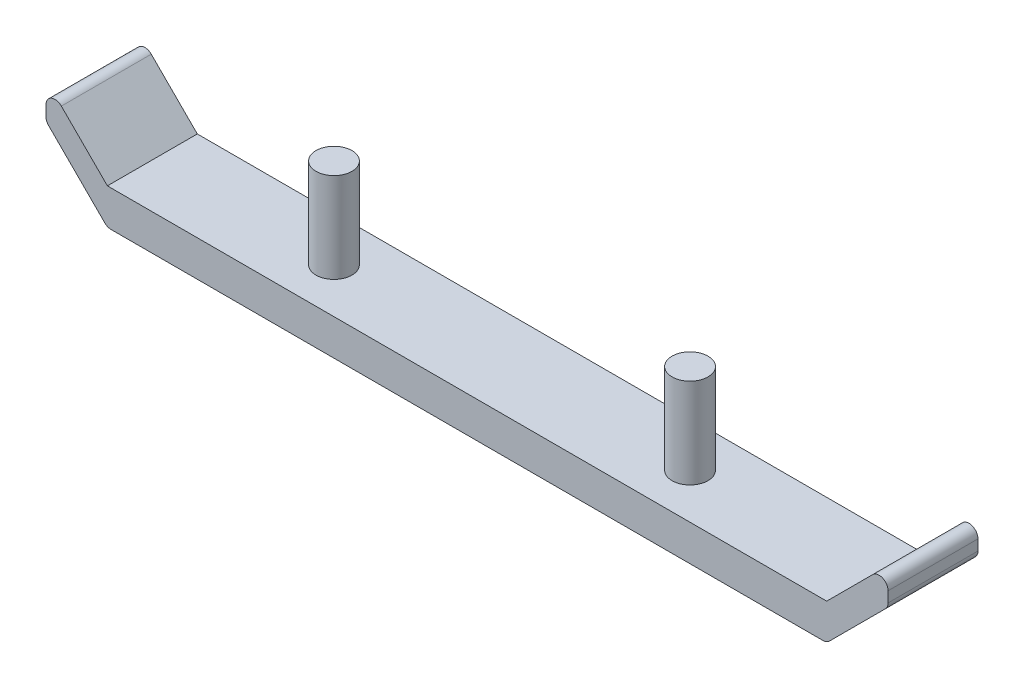
ISO-10303-21;
HEADER;
FILE_DESCRIPTION(('STEP AP214'),'2;1');
FILE_NAME('part.step','',(''),(''),'','','');
FILE_SCHEMA(('AUTOMOTIVE_DESIGN { 1 0 10303 214 1 1 1 1 }'));
ENDSEC;
DATA;
#1=APPLICATION_CONTEXT('core data for automotive mechanical design processes');
#2=APPLICATION_PROTOCOL_DEFINITION('international standard','automotive_design',2000,#1);
#3=PRODUCT_CONTEXT('',#1,'mechanical');
#4=PRODUCT('Part','Part','',(#3));
#5=PRODUCT_RELATED_PRODUCT_CATEGORY('part','',(#4));
#6=PRODUCT_DEFINITION_FORMATION('','',#4);
#7=PRODUCT_DEFINITION_CONTEXT('part definition',#1,'design');
#8=PRODUCT_DEFINITION('design','',#6,#7);
#9=PRODUCT_DEFINITION_SHAPE('','',#8);
#10=(LENGTH_UNIT() NAMED_UNIT(*) SI_UNIT(.MILLI.,.METRE.));
#11=(NAMED_UNIT(*) PLANE_ANGLE_UNIT() SI_UNIT($,.RADIAN.));
#12=(NAMED_UNIT(*) SI_UNIT($,.STERADIAN.) SOLID_ANGLE_UNIT());
#13=UNCERTAINTY_MEASURE_WITH_UNIT(LENGTH_MEASURE(1.E-05),#10,'distance_accuracy_value','');
#14=(GEOMETRIC_REPRESENTATION_CONTEXT(3) GLOBAL_UNCERTAINTY_ASSIGNED_CONTEXT((#13)) GLOBAL_UNIT_ASSIGNED_CONTEXT((#10,
#11,#12)) REPRESENTATION_CONTEXT('',''));
#15=CARTESIAN_POINT('',(0.,0.,0.));
#16=DIRECTION('',(0.,0.,1.));
#17=DIRECTION('',(1.,0.,0.));
#18=AXIS2_PLACEMENT_3D('',#15,#16,#17);
#19=CARTESIAN_POINT('',(0.,-20.,25.));
#20=DIRECTION('',(0.,0.,-1.));
#21=DIRECTION('',(-1.,0.,0.));
#22=AXIS2_PLACEMENT_3D('',#19,#20,#21);
#23=PLANE('',#22);
#24=DIRECTION('',(-0.707106781186548,0.707106781186547,0.));
#25=VECTOR('',#24,1.);
#26=CARTESIAN_POINT('',(-217.071067811866,17.0710678118655,25.));
#27=LINE('',#26,#25);
#28=CARTESIAN_POINT('',(-200.,0.,25.));
#29=VERTEX_POINT('',#28);
#30=CARTESIAN_POINT('',(-225.606601717798,25.6066017177982,25.));
#31=VERTEX_POINT('',#30);
#32=EDGE_CURVE('E169',#29,#31,#27,.T.);
#33=ORIENTED_EDGE('',*,*,#32,.T.);
#34=CARTESIAN_POINT('',(-229.142135623731,22.0710678118655,25.));
#35=DIRECTION('',(0.,0.,-1.));
#36=DIRECTION('',(-1.,0.,0.));
#37=AXIS2_PLACEMENT_3D('',#34,#35,#36);
#38=CIRCLE('',#37,5.);
#39=CARTESIAN_POINT('',(-234.142135623731,22.0710678118655,25.));
#40=VERTEX_POINT('',#39);
#41=EDGE_CURVE('E260',#31,#40,#38,.F.);
#42=ORIENTED_EDGE('',*,*,#41,.T.);
#43=DIRECTION('',(0.,1.,0.));
#44=VECTOR('',#43,1.);
#45=CARTESIAN_POINT('',(-234.142135623731,24.142135623731,25.));
#46=LINE('',#45,#44);
#47=CARTESIAN_POINT('',(-234.142135623731,16.2132034355965,25.));
#48=VERTEX_POINT('',#47);
#49=EDGE_CURVE('E180',#48,#40,#46,.T.);
#50=ORIENTED_EDGE('',*,*,#49,.F.);
#51=CARTESIAN_POINT('',(-229.142135623731,16.2132034355965,25.));
#52=DIRECTION('',(0.,0.,-1.));
#53=DIRECTION('',(-1.,0.,0.));
#54=AXIS2_PLACEMENT_3D('',#51,#52,#53);
#55=CIRCLE('',#54,5.);
#56=CARTESIAN_POINT('',(-232.677669529664,12.6776695296637,25.));
#57=VERTEX_POINT('',#56);
#58=EDGE_CURVE('E257',#48,#57,#55,.F.);
#59=ORIENTED_EDGE('',*,*,#58,.T.);
#60=DIRECTION('',(-0.707106781186548,0.707106781186547,0.));
#61=VECTOR('',#60,1.);
#62=CARTESIAN_POINT('',(-227.071067811865,7.07106781186547,25.));
#63=LINE('',#62,#61);
#64=CARTESIAN_POINT('',(-201.464466094068,-18.5355339059328,25.));
#65=VERTEX_POINT('',#64);
#66=EDGE_CURVE('E187',#65,#57,#63,.T.);
#67=ORIENTED_EDGE('',*,*,#66,.F.);
#68=CARTESIAN_POINT('',(-197.928932188134,-15.,25.));
#69=DIRECTION('',(0.,0.,-1.));
#70=DIRECTION('',(-1.,0.,0.));
#71=AXIS2_PLACEMENT_3D('',#68,#69,#70);
#72=CIRCLE('',#71,5.);
#73=CARTESIAN_POINT('',(-197.928932188134,-20.,25.));
#74=VERTEX_POINT('',#73);
#75=EDGE_CURVE('E248',#65,#74,#72,.F.);
#76=ORIENTED_EDGE('',*,*,#75,.T.);
#77=DIRECTION('',(-1.,0.,0.));
#78=VECTOR('',#77,1.);
#79=CARTESIAN_POINT('',(0.,-20.,25.));
#80=LINE('',#79,#78);
#81=CARTESIAN_POINT('',(197.928932188134,-20.,25.));
#82=VERTEX_POINT('',#81);
#83=EDGE_CURVE('E231',#82,#74,#80,.T.);
#84=ORIENTED_EDGE('',*,*,#83,.F.);
#85=CARTESIAN_POINT('',(197.928932188134,-15.,25.));
#86=DIRECTION('',(0.,0.,-1.));
#87=DIRECTION('',(-1.,0.,0.));
#88=AXIS2_PLACEMENT_3D('',#85,#86,#87);
#89=CIRCLE('',#88,5.);
#90=CARTESIAN_POINT('',(201.464466094068,-18.5355339059328,25.));
#91=VERTEX_POINT('',#90);
#92=EDGE_CURVE('E245',#82,#91,#89,.F.);
#93=ORIENTED_EDGE('',*,*,#92,.T.);
#94=DIRECTION('',(0.707106781186547,0.707106781186548,0.));
#95=VECTOR('',#94,1.);
#96=CARTESIAN_POINT('',(227.071067811865,7.07106781186547,25.));
#97=LINE('',#96,#95);
#98=CARTESIAN_POINT('',(232.677669529664,12.6776695296637,25.));
#99=VERTEX_POINT('',#98);
#100=EDGE_CURVE('E212',#91,#99,#97,.T.);
#101=ORIENTED_EDGE('',*,*,#100,.T.);
#102=CARTESIAN_POINT('',(229.142135623731,16.2132034355965,25.));
#103=DIRECTION('',(0.,0.,-1.));
#104=DIRECTION('',(-1.,0.,0.));
#105=AXIS2_PLACEMENT_3D('',#102,#103,#104);
#106=CIRCLE('',#105,5.);
#107=CARTESIAN_POINT('',(234.142135623731,16.2132034355965,25.));
#108=VERTEX_POINT('',#107);
#109=EDGE_CURVE('E251',#99,#108,#106,.F.);
#110=ORIENTED_EDGE('',*,*,#109,.T.);
#111=DIRECTION('',(0.,1.,0.));
#112=VECTOR('',#111,1.);
#113=CARTESIAN_POINT('',(234.142135623731,24.142135623731,25.));
#114=LINE('',#113,#112);
#115=CARTESIAN_POINT('',(234.142135623731,22.0710678118655,25.));
#116=VERTEX_POINT('',#115);
#117=EDGE_CURVE('E208',#108,#116,#114,.T.);
#118=ORIENTED_EDGE('',*,*,#117,.T.);
#119=CARTESIAN_POINT('',(229.142135623731,22.0710678118655,25.));
#120=DIRECTION('',(0.,0.,-1.));
#121=DIRECTION('',(-1.,0.,0.));
#122=AXIS2_PLACEMENT_3D('',#119,#120,#121);
#123=CIRCLE('',#122,5.);
#124=CARTESIAN_POINT('',(225.606601717798,25.6066017177982,25.));
#125=VERTEX_POINT('',#124);
#126=EDGE_CURVE('E254',#116,#125,#123,.F.);
#127=ORIENTED_EDGE('',*,*,#126,.T.);
#128=DIRECTION('',(-0.707106781186548,-0.707106781186547,0.));
#129=VECTOR('',#128,1.);
#130=CARTESIAN_POINT('',(217.071067811866,17.0710678118655,25.));
#131=LINE('',#130,#129);
#132=CARTESIAN_POINT('',(200.,0.,25.));
#133=VERTEX_POINT('',#132);
#134=EDGE_CURVE('E171',#125,#133,#131,.T.);
#135=ORIENTED_EDGE('',*,*,#134,.T.);
#136=DIRECTION('',(-1.,0.,0.));
#137=VECTOR('',#136,1.);
#138=CARTESIAN_POINT('',(0.,0.,25.));
#139=LINE('',#138,#137);
#140=EDGE_CURVE('E157',#133,#29,#139,.T.);
#141=ORIENTED_EDGE('',*,*,#140,.T.);
#142=EDGE_LOOP('',(#33,#42,#50,#59,#67,#76,#84,#93,#101,#110,#118,#127,#135,#141));
#143=FACE_BOUND('',#142,.T.);
#144=ADVANCED_FACE('F17',(#143),#23,.F.);
#145=CARTESIAN_POINT('',(0.,-20.,-25.));
#146=DIRECTION('',(0.,0.,-1.));
#147=DIRECTION('',(-1.,0.,0.));
#148=AXIS2_PLACEMENT_3D('',#145,#146,#147);
#149=PLANE('',#148);
#150=DIRECTION('',(0.,1.,0.));
#151=VECTOR('',#150,1.);
#152=CARTESIAN_POINT('',(-234.142135623731,24.142135623731,-25.));
#153=LINE('',#152,#151);
#154=CARTESIAN_POINT('',(-234.142135623731,16.2132034355965,-25.));
#155=VERTEX_POINT('',#154);
#156=CARTESIAN_POINT('',(-234.142135623731,22.0710678118655,-25.));
#157=VERTEX_POINT('',#156);
#158=EDGE_CURVE('E345',#155,#157,#153,.T.);
#159=ORIENTED_EDGE('',*,*,#158,.T.);
#160=CARTESIAN_POINT('',(-229.142135623731,22.0710678118655,-25.));
#161=DIRECTION('',(0.,0.,-1.));
#162=DIRECTION('',(-1.,0.,0.));
#163=AXIS2_PLACEMENT_3D('',#160,#161,#162);
#164=CIRCLE('',#163,5.);
#165=CARTESIAN_POINT('',(-225.606601717798,25.6066017177982,-25.));
#166=VERTEX_POINT('',#165);
#167=EDGE_CURVE('E283',#157,#166,#164,.T.);
#168=ORIENTED_EDGE('',*,*,#167,.T.);
#169=DIRECTION('',(-0.707106781186548,0.707106781186547,0.));
#170=VECTOR('',#169,1.);
#171=CARTESIAN_POINT('',(-217.071067811866,17.0710678118655,-25.));
#172=LINE('',#171,#170);
#173=CARTESIAN_POINT('',(-200.,0.,-25.));
#174=VERTEX_POINT('',#173);
#175=EDGE_CURVE('E195',#174,#166,#172,.T.);
#176=ORIENTED_EDGE('',*,*,#175,.F.);
#177=DIRECTION('',(-1.,0.,0.));
#178=VECTOR('',#177,1.);
#179=CARTESIAN_POINT('',(0.,0.,-25.));
#180=LINE('',#179,#178);
#181=CARTESIAN_POINT('',(200.,0.,-25.));
#182=VERTEX_POINT('',#181);
#183=EDGE_CURVE('E160',#182,#174,#180,.T.);
#184=ORIENTED_EDGE('',*,*,#183,.F.);
#185=DIRECTION('',(-0.707106781186548,-0.707106781186547,0.));
#186=VECTOR('',#185,1.);
#187=CARTESIAN_POINT('',(217.071067811866,17.0710678118655,-25.));
#188=LINE('',#187,#186);
#189=CARTESIAN_POINT('',(225.606601717798,25.6066017177982,-25.));
#190=VERTEX_POINT('',#189);
#191=EDGE_CURVE('E204',#190,#182,#188,.T.);
#192=ORIENTED_EDGE('',*,*,#191,.F.);
#193=CARTESIAN_POINT('',(229.142135623731,22.0710678118655,-25.));
#194=DIRECTION('',(0.,0.,-1.));
#195=DIRECTION('',(-1.,0.,0.));
#196=AXIS2_PLACEMENT_3D('',#193,#194,#195);
#197=CIRCLE('',#196,5.);
#198=CARTESIAN_POINT('',(234.142135623731,22.0710678118655,-25.));
#199=VERTEX_POINT('',#198);
#200=EDGE_CURVE('E277',#190,#199,#197,.T.);
#201=ORIENTED_EDGE('',*,*,#200,.T.);
#202=DIRECTION('',(0.,1.,0.));
#203=VECTOR('',#202,1.);
#204=CARTESIAN_POINT('',(234.142135623731,24.142135623731,-25.));
#205=LINE('',#204,#203);
#206=CARTESIAN_POINT('',(234.142135623731,16.2132034355965,-25.));
#207=VERTEX_POINT('',#206);
#208=EDGE_CURVE('E196',#207,#199,#205,.T.);
#209=ORIENTED_EDGE('',*,*,#208,.F.);
#210=CARTESIAN_POINT('',(229.142135623731,16.2132034355965,-25.));
#211=DIRECTION('',(0.,0.,-1.));
#212=DIRECTION('',(-1.,0.,0.));
#213=AXIS2_PLACEMENT_3D('',#210,#211,#212);
#214=CIRCLE('',#213,5.);
#215=CARTESIAN_POINT('',(232.677669529664,12.6776695296637,-25.));
#216=VERTEX_POINT('',#215);
#217=EDGE_CURVE('E274',#207,#216,#214,.T.);
#218=ORIENTED_EDGE('',*,*,#217,.T.);
#219=DIRECTION('',(0.707106781186547,0.707106781186548,0.));
#220=VECTOR('',#219,1.);
#221=CARTESIAN_POINT('',(227.071067811865,7.07106781186547,-25.));
#222=LINE('',#221,#220);
#223=CARTESIAN_POINT('',(201.464466094068,-18.5355339059328,-25.));
#224=VERTEX_POINT('',#223);
#225=EDGE_CURVE('E200',#224,#216,#222,.T.);
#226=ORIENTED_EDGE('',*,*,#225,.F.);
#227=CARTESIAN_POINT('',(197.928932188134,-15.,-25.));
#228=DIRECTION('',(0.,0.,-1.));
#229=DIRECTION('',(-1.,0.,0.));
#230=AXIS2_PLACEMENT_3D('',#227,#228,#229);
#231=CIRCLE('',#230,5.);
#232=CARTESIAN_POINT('',(197.928932188134,-20.,-25.));
#233=VERTEX_POINT('',#232);
#234=EDGE_CURVE('E270',#224,#233,#231,.T.);
#235=ORIENTED_EDGE('',*,*,#234,.T.);
#236=DIRECTION('',(-1.,0.,0.));
#237=VECTOR('',#236,1.);
#238=CARTESIAN_POINT('',(0.,-20.,-25.));
#239=LINE('',#238,#237);
#240=CARTESIAN_POINT('',(-197.928932188134,-20.,-25.));
#241=VERTEX_POINT('',#240);
#242=EDGE_CURVE('E230',#233,#241,#239,.T.);
#243=ORIENTED_EDGE('',*,*,#242,.T.);
#244=CARTESIAN_POINT('',(-197.928932188134,-15.,-25.));
#245=DIRECTION('',(0.,0.,-1.));
#246=DIRECTION('',(-1.,0.,0.));
#247=AXIS2_PLACEMENT_3D('',#244,#245,#246);
#248=CIRCLE('',#247,5.);
#249=CARTESIAN_POINT('',(-201.464466094068,-18.5355339059328,-25.));
#250=VERTEX_POINT('',#249);
#251=EDGE_CURVE('E49',#241,#250,#248,.T.);
#252=ORIENTED_EDGE('',*,*,#251,.T.);
#253=DIRECTION('',(-0.707106781186548,0.707106781186547,0.));
#254=VECTOR('',#253,1.);
#255=CARTESIAN_POINT('',(-227.071067811865,7.07106781186547,-25.));
#256=LINE('',#255,#254);
#257=CARTESIAN_POINT('',(-232.677669529664,12.6776695296637,-25.));
#258=VERTEX_POINT('',#257);
#259=EDGE_CURVE('E190',#250,#258,#256,.T.);
#260=ORIENTED_EDGE('',*,*,#259,.T.);
#261=CARTESIAN_POINT('',(-229.142135623731,16.2132034355965,-25.));
#262=DIRECTION('',(0.,0.,-1.));
#263=DIRECTION('',(-1.,0.,0.));
#264=AXIS2_PLACEMENT_3D('',#261,#262,#263);
#265=CIRCLE('',#264,5.);
#266=EDGE_CURVE('E280',#258,#155,#265,.T.);
#267=ORIENTED_EDGE('',*,*,#266,.T.);
#268=EDGE_LOOP('',(#159,#168,#176,#184,#192,#201,#209,#218,#226,#235,#243,#252,#260,#267));
#269=FACE_BOUND('',#268,.T.);
#270=ADVANCED_FACE('F327',(#269),#149,.T.);
#271=CARTESIAN_POINT('',(0.,-20.,0.));
#272=DIRECTION('',(0.,-1.,0.));
#273=DIRECTION('',(1.,0.,0.));
#274=AXIS2_PLACEMENT_3D('',#271,#272,#273);
#275=PLANE('',#274);
#276=ORIENTED_EDGE('',*,*,#83,.T.);
#277=DIRECTION('',(0.,0.,-1.));
#278=VECTOR('',#277,1.);
#279=CARTESIAN_POINT('',(-197.928932188134,-20.,-25.));
#280=LINE('',#279,#278);
#281=EDGE_CURVE('E11',#74,#241,#280,.T.);
#282=ORIENTED_EDGE('',*,*,#281,.T.);
#283=ORIENTED_EDGE('',*,*,#242,.F.);
#284=DIRECTION('',(0.,0.,-1.));
#285=VECTOR('',#284,1.);
#286=CARTESIAN_POINT('',(197.928932188134,-20.,0.));
#287=LINE('',#286,#285);
#288=EDGE_CURVE('E26',#233,#82,#287,.F.);
#289=ORIENTED_EDGE('',*,*,#288,.T.);
#290=EDGE_LOOP('',(#276,#282,#283,#289));
#291=FACE_BOUND('',#290,.T.);
#292=ADVANCED_FACE('F314',(#291),#275,.T.);
#293=CARTESIAN_POINT('',(0.,0.,0.));
#294=DIRECTION('',(0.,-1.,0.));
#295=DIRECTION('',(1.,0.,0.));
#296=AXIS2_PLACEMENT_3D('',#293,#294,#295);
#297=PLANE('',#296);
#298=CARTESIAN_POINT('',(-99.,0.,0.));
#299=DIRECTION('',(0.,-1.,0.));
#300=DIRECTION('',(0.,0.,-1.));
#301=AXIS2_PLACEMENT_3D('',#298,#299,#300);
#302=CIRCLE('',#301,10.);
#303=CARTESIAN_POINT('',(-99.,0.,-10.));
#304=VERTEX_POINT('',#303);
#305=EDGE_CURVE('E229',#304,#304,#302,.F.);
#306=ORIENTED_EDGE('',*,*,#305,.F.);
#307=EDGE_LOOP('',(#306));
#308=FACE_BOUND('',#307,.T.);
#309=CARTESIAN_POINT('',(99.,0.,0.));
#310=DIRECTION('',(0.,1.,0.));
#311=DIRECTION('',(0.,0.,1.));
#312=AXIS2_PLACEMENT_3D('',#309,#310,#311);
#313=CIRCLE('',#312,10.);
#314=CARTESIAN_POINT('',(99.,0.,10.));
#315=VERTEX_POINT('',#314);
#316=EDGE_CURVE('E225',#315,#315,#313,.T.);
#317=ORIENTED_EDGE('',*,*,#316,.F.);
#318=EDGE_LOOP('',(#317));
#319=FACE_BOUND('',#318,.T.);
#320=DIRECTION('',(0.,0.,-1.));
#321=VECTOR('',#320,1.);
#322=CARTESIAN_POINT('',(200.,0.,0.));
#323=LINE('',#322,#321);
#324=EDGE_CURVE('E173',#133,#182,#323,.T.);
#325=ORIENTED_EDGE('',*,*,#324,.T.);
#326=ORIENTED_EDGE('',*,*,#183,.T.);
#327=DIRECTION('',(0.,0.,-1.));
#328=VECTOR('',#327,1.);
#329=CARTESIAN_POINT('',(-200.,0.,0.));
#330=LINE('',#329,#328);
#331=EDGE_CURVE('E153',#29,#174,#330,.T.);
#332=ORIENTED_EDGE('',*,*,#331,.F.);
#333=ORIENTED_EDGE('',*,*,#140,.F.);
#334=EDGE_LOOP('',(#325,#326,#332,#333));
#335=FACE_BOUND('',#334,.T.);
#336=ADVANCED_FACE('F156',(#308,#319,#335),#297,.F.);
#337=CARTESIAN_POINT('',(99.,50.,0.));
#338=DIRECTION('',(0.,-1.,0.));
#339=DIRECTION('',(0.,0.,-1.));
#340=AXIS2_PLACEMENT_3D('',#337,#338,#339);
#341=CYLINDRICAL_SURFACE('',#340,10.);
#342=CARTESIAN_POINT('',(99.,50.,0.));
#343=DIRECTION('',(0.,1.,0.));
#344=DIRECTION('',(0.,0.,1.));
#345=AXIS2_PLACEMENT_3D('',#342,#343,#344);
#346=CIRCLE('',#345,10.);
#347=CARTESIAN_POINT('',(99.,50.,10.));
#348=VERTEX_POINT('',#347);
#349=EDGE_CURVE('E221',#348,#348,#346,.T.);
#350=ORIENTED_EDGE('',*,*,#349,.F.);
#351=EDGE_LOOP('',(#350));
#352=FACE_BOUND('',#351,.T.);
#353=ORIENTED_EDGE('',*,*,#316,.T.);
#354=EDGE_LOOP('',(#353));
#355=FACE_BOUND('',#354,.T.);
#356=ADVANCED_FACE('F383',(#352,#355),#341,.T.);
#357=CARTESIAN_POINT('',(0.,50.,0.));
#358=DIRECTION('',(0.,1.,0.));
#359=DIRECTION('',(-1.,0.,0.));
#360=AXIS2_PLACEMENT_3D('',#357,#358,#359);
#361=PLANE('',#360);
#362=ORIENTED_EDGE('',*,*,#349,.T.);
#363=EDGE_LOOP('',(#362));
#364=FACE_BOUND('',#363,.T.);
#365=ADVANCED_FACE('F389',(#364),#361,.T.);
#366=CARTESIAN_POINT('',(-99.,50.,0.));
#367=DIRECTION('',(0.,-1.,0.));
#368=DIRECTION('',(0.,0.,-1.));
#369=AXIS2_PLACEMENT_3D('',#366,#367,#368);
#370=CYLINDRICAL_SURFACE('',#369,10.);
#371=CARTESIAN_POINT('',(-99.,50.,0.));
#372=DIRECTION('',(0.,1.,0.));
#373=DIRECTION('',(0.,0.,1.));
#374=AXIS2_PLACEMENT_3D('',#371,#372,#373);
#375=CIRCLE('',#374,10.);
#376=CARTESIAN_POINT('',(-99.,50.,10.));
#377=VERTEX_POINT('',#376);
#378=EDGE_CURVE('E207',#377,#377,#375,.T.);
#379=ORIENTED_EDGE('',*,*,#378,.F.);
#380=EDGE_LOOP('',(#379));
#381=FACE_BOUND('',#380,.T.);
#382=ORIENTED_EDGE('',*,*,#305,.T.);
#383=EDGE_LOOP('',(#382));
#384=FACE_BOUND('',#383,.T.);
#385=ADVANCED_FACE('F393',(#381,#384),#370,.T.);
#386=CARTESIAN_POINT('',(0.,50.,0.));
#387=DIRECTION('',(0.,1.,0.));
#388=DIRECTION('',(-1.,0.,0.));
#389=AXIS2_PLACEMENT_3D('',#386,#387,#388);
#390=PLANE('',#389);
#391=ORIENTED_EDGE('',*,*,#378,.T.);
#392=EDGE_LOOP('',(#391));
#393=FACE_BOUND('',#392,.T.);
#394=ADVANCED_FACE('F397',(#393),#390,.T.);
#395=CARTESIAN_POINT('',(227.071067811865,7.07106781186547,-25.));
#396=DIRECTION('',(0.707106781186548,-0.707106781186547,0.));
#397=DIRECTION('',(0.707106781186547,0.707106781186548,0.));
#398=AXIS2_PLACEMENT_3D('',#395,#396,#397);
#399=PLANE('',#398);
#400=ORIENTED_EDGE('',*,*,#225,.T.);
#401=DIRECTION('',(0.,0.,1.));
#402=VECTOR('',#401,1.);
#403=CARTESIAN_POINT('',(232.677669529664,12.6776695296637,-25.));
#404=LINE('',#403,#402);
#405=EDGE_CURVE('E305',#216,#99,#404,.T.);
#406=ORIENTED_EDGE('',*,*,#405,.T.);
#407=ORIENTED_EDGE('',*,*,#100,.F.);
#408=DIRECTION('',(0.,0.,-1.));
#409=VECTOR('',#408,1.);
#410=CARTESIAN_POINT('',(201.464466094068,-18.5355339059328,-25.));
#411=LINE('',#410,#409);
#412=EDGE_CURVE('E301',#91,#224,#411,.T.);
#413=ORIENTED_EDGE('',*,*,#412,.T.);
#414=EDGE_LOOP('',(#400,#406,#407,#413));
#415=FACE_BOUND('',#414,.T.);
#416=ADVANCED_FACE('F324',(#415),#399,.T.);
#417=CARTESIAN_POINT('',(234.142135623731,24.142135623731,-25.));
#418=DIRECTION('',(1.,0.,0.));
#419=DIRECTION('',(0.,0.,-1.));
#420=AXIS2_PLACEMENT_3D('',#417,#418,#419);
#421=PLANE('',#420);
#422=ORIENTED_EDGE('',*,*,#208,.T.);
#423=DIRECTION('',(0.,0.,1.));
#424=VECTOR('',#423,1.);
#425=CARTESIAN_POINT('',(234.142135623731,22.0710678118655,-25.));
#426=LINE('',#425,#424);
#427=EDGE_CURVE('E294',#199,#116,#426,.T.);
#428=ORIENTED_EDGE('',*,*,#427,.T.);
#429=ORIENTED_EDGE('',*,*,#117,.F.);
#430=DIRECTION('',(0.,0.,1.));
#431=VECTOR('',#430,1.);
#432=CARTESIAN_POINT('',(234.142135623731,16.2132034355965,-25.));
#433=LINE('',#432,#431);
#434=EDGE_CURVE('E291',#108,#207,#433,.F.);
#435=ORIENTED_EDGE('',*,*,#434,.T.);
#436=EDGE_LOOP('',(#422,#428,#429,#435));
#437=FACE_BOUND('',#436,.T.);
#438=ADVANCED_FACE('F335',(#437),#421,.T.);
#439=CARTESIAN_POINT('',(217.071067811866,17.0710678118655,-25.));
#440=DIRECTION('',(-0.707106781186547,0.707106781186548,0.));
#441=DIRECTION('',(-0.707106781186548,-0.707106781186547,0.));
#442=AXIS2_PLACEMENT_3D('',#439,#440,#441);
#443=PLANE('',#442);
#444=ORIENTED_EDGE('',*,*,#134,.F.);
#445=DIRECTION('',(0.,0.,1.));
#446=VECTOR('',#445,1.);
#447=CARTESIAN_POINT('',(225.606601717798,25.6066017177982,-25.));
#448=LINE('',#447,#446);
#449=EDGE_CURVE('E298',#125,#190,#448,.F.);
#450=ORIENTED_EDGE('',*,*,#449,.T.);
#451=ORIENTED_EDGE('',*,*,#191,.T.);
#452=ORIENTED_EDGE('',*,*,#324,.F.);
#453=EDGE_LOOP('',(#444,#450,#451,#452));
#454=FACE_BOUND('',#453,.T.);
#455=ADVANCED_FACE('F342',(#454),#443,.T.);
#456=CARTESIAN_POINT('',(-227.071067811865,7.07106781186547,-25.));
#457=DIRECTION('',(0.707106781186547,0.707106781186548,0.));
#458=DIRECTION('',(-0.707106781186548,0.707106781186547,0.));
#459=AXIS2_PLACEMENT_3D('',#456,#457,#458);
#460=PLANE('',#459);
#461=ORIENTED_EDGE('',*,*,#66,.T.);
#462=DIRECTION('',(0.,0.,1.));
#463=VECTOR('',#462,1.);
#464=CARTESIAN_POINT('',(-232.677669529664,12.6776695296637,-25.));
#465=LINE('',#464,#463);
#466=EDGE_CURVE('E38',#57,#258,#465,.F.);
#467=ORIENTED_EDGE('',*,*,#466,.T.);
#468=ORIENTED_EDGE('',*,*,#259,.F.);
#469=DIRECTION('',(0.,0.,-1.));
#470=VECTOR('',#469,1.);
#471=CARTESIAN_POINT('',(-201.464466094068,-18.5355339059328,25.));
#472=LINE('',#471,#470);
#473=EDGE_CURVE('E286',#250,#65,#472,.F.);
#474=ORIENTED_EDGE('',*,*,#473,.T.);
#475=EDGE_LOOP('',(#461,#467,#468,#474));
#476=FACE_BOUND('',#475,.T.);
#477=ADVANCED_FACE('F408',(#476),#460,.F.);
#478=CARTESIAN_POINT('',(-217.071067811866,17.0710678118655,-25.));
#479=DIRECTION('',(0.707106781186547,0.707106781186548,0.));
#480=DIRECTION('',(-0.707106781186548,0.707106781186547,0.));
#481=AXIS2_PLACEMENT_3D('',#478,#479,#480);
#482=PLANE('',#481);
#483=ORIENTED_EDGE('',*,*,#175,.T.);
#484=DIRECTION('',(0.,0.,1.));
#485=VECTOR('',#484,1.);
#486=CARTESIAN_POINT('',(-225.606601717798,25.6066017177982,25.));
#487=LINE('',#486,#485);
#488=EDGE_CURVE('E178',#166,#31,#487,.T.);
#489=ORIENTED_EDGE('',*,*,#488,.T.);
#490=ORIENTED_EDGE('',*,*,#32,.F.);
#491=ORIENTED_EDGE('',*,*,#331,.T.);
#492=EDGE_LOOP('',(#483,#489,#490,#491));
#493=FACE_BOUND('',#492,.T.);
#494=ADVANCED_FACE('F176',(#493),#482,.T.);
#495=CARTESIAN_POINT('',(-234.142135623731,24.142135623731,-25.));
#496=DIRECTION('',(1.,0.,0.));
#497=DIRECTION('',(0.,0.,-1.));
#498=AXIS2_PLACEMENT_3D('',#495,#496,#497);
#499=PLANE('',#498);
#500=ORIENTED_EDGE('',*,*,#49,.T.);
#501=DIRECTION('',(0.,0.,1.));
#502=VECTOR('',#501,1.);
#503=CARTESIAN_POINT('',(-234.142135623731,22.0710678118655,-25.));
#504=LINE('',#503,#502);
#505=EDGE_CURVE('E267',#40,#157,#504,.F.);
#506=ORIENTED_EDGE('',*,*,#505,.T.);
#507=ORIENTED_EDGE('',*,*,#158,.F.);
#508=DIRECTION('',(0.,0.,1.));
#509=VECTOR('',#508,1.);
#510=CARTESIAN_POINT('',(-234.142135623731,16.2132034355965,-25.));
#511=LINE('',#510,#509);
#512=EDGE_CURVE('E263',#155,#48,#511,.T.);
#513=ORIENTED_EDGE('',*,*,#512,.T.);
#514=EDGE_LOOP('',(#500,#506,#507,#513));
#515=FACE_BOUND('',#514,.T.);
#516=ADVANCED_FACE('F361',(#515),#499,.F.);
#517=CARTESIAN_POINT('',(-229.142135623731,22.0710678118655,-25.));
#518=DIRECTION('',(0.,0.,-1.));
#519=DIRECTION('',(-1.,0.,0.));
#520=AXIS2_PLACEMENT_3D('',#517,#518,#519);
#521=CYLINDRICAL_SURFACE('',#520,5.);
#522=ORIENTED_EDGE('',*,*,#167,.F.);
#523=ORIENTED_EDGE('',*,*,#505,.F.);
#524=ORIENTED_EDGE('',*,*,#41,.F.);
#525=ORIENTED_EDGE('',*,*,#488,.F.);
#526=EDGE_LOOP('',(#522,#523,#524,#525));
#527=FACE_BOUND('',#526,.T.);
#528=ADVANCED_FACE('F364',(#527),#521,.T.);
#529=CARTESIAN_POINT('',(-229.142135623731,16.2132034355965,-25.));
#530=DIRECTION('',(0.,0.,1.));
#531=DIRECTION('',(1.,0.,0.));
#532=AXIS2_PLACEMENT_3D('',#529,#530,#531);
#533=CYLINDRICAL_SURFACE('',#532,5.);
#534=ORIENTED_EDGE('',*,*,#266,.F.);
#535=ORIENTED_EDGE('',*,*,#466,.F.);
#536=ORIENTED_EDGE('',*,*,#58,.F.);
#537=ORIENTED_EDGE('',*,*,#512,.F.);
#538=EDGE_LOOP('',(#534,#535,#536,#537));
#539=FACE_BOUND('',#538,.T.);
#540=ADVANCED_FACE('F358',(#539),#533,.T.);
#541=CARTESIAN_POINT('',(229.142135623731,22.0710678118655,-25.));
#542=DIRECTION('',(0.,0.,1.));
#543=DIRECTION('',(1.,0.,0.));
#544=AXIS2_PLACEMENT_3D('',#541,#542,#543);
#545=CYLINDRICAL_SURFACE('',#544,5.);
#546=ORIENTED_EDGE('',*,*,#200,.F.);
#547=ORIENTED_EDGE('',*,*,#449,.F.);
#548=ORIENTED_EDGE('',*,*,#126,.F.);
#549=ORIENTED_EDGE('',*,*,#427,.F.);
#550=EDGE_LOOP('',(#546,#547,#548,#549));
#551=FACE_BOUND('',#550,.T.);
#552=ADVANCED_FACE('F339',(#551),#545,.T.);
#553=CARTESIAN_POINT('',(229.142135623731,16.2132034355965,-25.));
#554=DIRECTION('',(0.,0.,1.));
#555=DIRECTION('',(1.,0.,0.));
#556=AXIS2_PLACEMENT_3D('',#553,#554,#555);
#557=CYLINDRICAL_SURFACE('',#556,5.);
#558=ORIENTED_EDGE('',*,*,#217,.F.);
#559=ORIENTED_EDGE('',*,*,#434,.F.);
#560=ORIENTED_EDGE('',*,*,#109,.F.);
#561=ORIENTED_EDGE('',*,*,#405,.F.);
#562=EDGE_LOOP('',(#558,#559,#560,#561));
#563=FACE_BOUND('',#562,.T.);
#564=ADVANCED_FACE('F332',(#563),#557,.T.);
#565=CARTESIAN_POINT('',(-197.928932188134,-15.,0.));
#566=DIRECTION('',(0.,0.,1.));
#567=DIRECTION('',(1.,0.,0.));
#568=AXIS2_PLACEMENT_3D('',#565,#566,#567);
#569=CYLINDRICAL_SURFACE('',#568,5.);
#570=ORIENTED_EDGE('',*,*,#75,.F.);
#571=ORIENTED_EDGE('',*,*,#473,.F.);
#572=ORIENTED_EDGE('',*,*,#251,.F.);
#573=ORIENTED_EDGE('',*,*,#281,.F.);
#574=EDGE_LOOP('',(#570,#571,#572,#573));
#575=FACE_BOUND('',#574,.T.);
#576=ADVANCED_FACE('F415',(#575),#569,.T.);
#577=CARTESIAN_POINT('',(197.928932188134,-15.,-25.));
#578=DIRECTION('',(0.,0.,-1.));
#579=DIRECTION('',(-1.,0.,0.));
#580=AXIS2_PLACEMENT_3D('',#577,#578,#579);
#581=CYLINDRICAL_SURFACE('',#580,5.);
#582=ORIENTED_EDGE('',*,*,#92,.F.);
#583=ORIENTED_EDGE('',*,*,#288,.F.);
#584=ORIENTED_EDGE('',*,*,#234,.F.);
#585=ORIENTED_EDGE('',*,*,#412,.F.);
#586=EDGE_LOOP('',(#582,#583,#584,#585));
#587=FACE_BOUND('',#586,.T.);
#588=ADVANCED_FACE('F19',(#587),#581,.T.);
#589=CLOSED_SHELL('',(#144,#270,#292,#336,#356,#365,#385,#394,#416,#438,#455,#477,#494,#516,
#528,#540,#552,#564,#576,#588));
#590=MANIFOLD_SOLID_BREP('B1',#589);
#591=ADVANCED_BREP_SHAPE_REPRESENTATION('',(#18,#590),#14);
#592=SHAPE_DEFINITION_REPRESENTATION(#9,#591);
ENDSEC;
END-ISO-10303-21;
